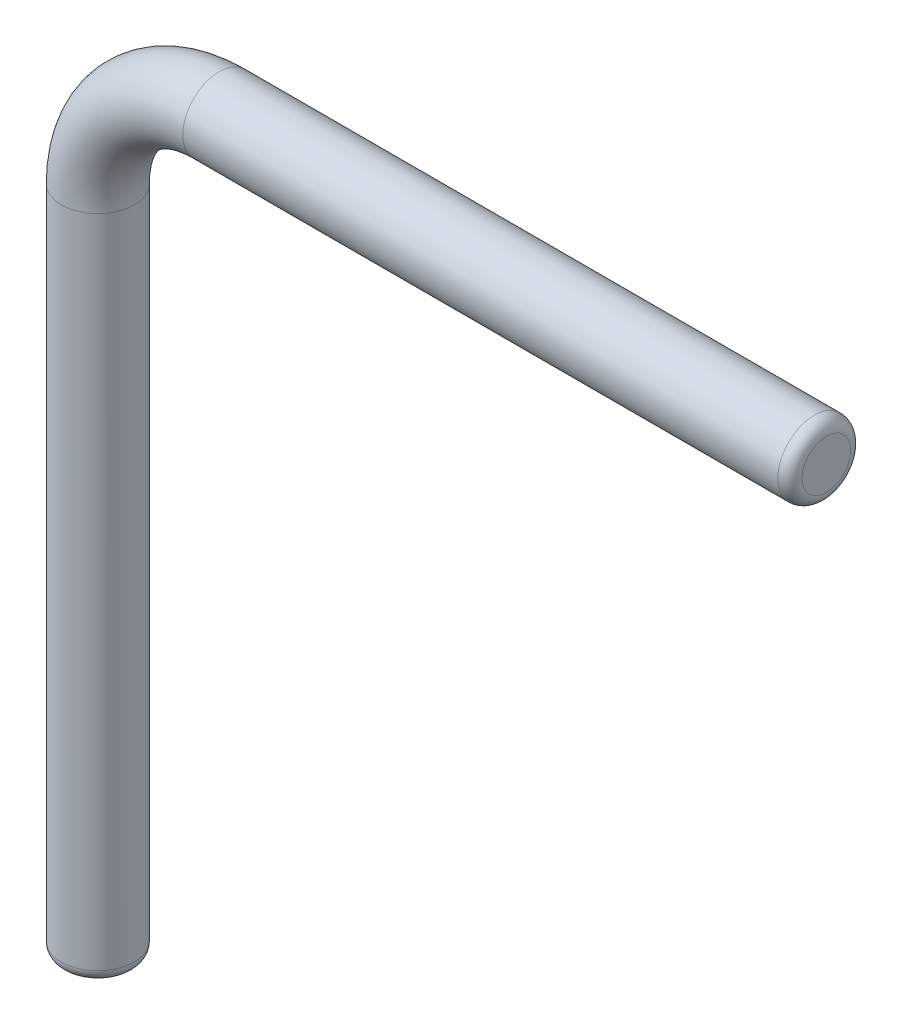
ISO-10303-21;
HEADER;
FILE_DESCRIPTION(('STEP AP214'),'2;1');
FILE_NAME('part.step','',(''),(''),'','','');
FILE_SCHEMA(('AUTOMOTIVE_DESIGN { 1 0 10303 214 1 1 1 1 }'));
ENDSEC;
DATA;
#1=APPLICATION_CONTEXT('core data for automotive mechanical design processes');
#2=APPLICATION_PROTOCOL_DEFINITION('international standard','automotive_design',2000,#1);
#3=PRODUCT_CONTEXT('',#1,'mechanical');
#4=PRODUCT('Part','Part','',(#3));
#5=PRODUCT_RELATED_PRODUCT_CATEGORY('part','',(#4));
#6=PRODUCT_DEFINITION_FORMATION('','',#4);
#7=PRODUCT_DEFINITION_CONTEXT('part definition',#1,'design');
#8=PRODUCT_DEFINITION('design','',#6,#7);
#9=PRODUCT_DEFINITION_SHAPE('','',#8);
#10=(LENGTH_UNIT() NAMED_UNIT(*) SI_UNIT(.MILLI.,.METRE.));
#11=(NAMED_UNIT(*) PLANE_ANGLE_UNIT() SI_UNIT($,.RADIAN.));
#12=(NAMED_UNIT(*) SI_UNIT($,.STERADIAN.) SOLID_ANGLE_UNIT());
#13=UNCERTAINTY_MEASURE_WITH_UNIT(LENGTH_MEASURE(1.E-05),#10,'distance_accuracy_value','');
#14=(GEOMETRIC_REPRESENTATION_CONTEXT(3) GLOBAL_UNCERTAINTY_ASSIGNED_CONTEXT((#13)) GLOBAL_UNIT_ASSIGNED_CONTEXT((#10,
#11,#12)) REPRESENTATION_CONTEXT('',''));
#15=CARTESIAN_POINT('',(0.,0.,0.));
#16=DIRECTION('',(0.,0.,1.));
#17=DIRECTION('',(1.,0.,0.));
#18=AXIS2_PLACEMENT_3D('',#15,#16,#17);
#19=CARTESIAN_POINT('',(1.,6.5,0.));
#20=DIRECTION('',(1.,0.,0.));
#21=DIRECTION('',(0.,0.,-1.));
#22=AXIS2_PLACEMENT_3D('',#19,#20,#21);
#23=CYLINDRICAL_SURFACE('',#22,0.3);
#24=CARTESIAN_POINT('',(5.9,6.5,0.));
#25=DIRECTION('',(1.,0.,0.));
#26=DIRECTION('',(0.,1.,0.));
#27=AXIS2_PLACEMENT_3D('',#24,#25,#26);
#28=CIRCLE('',#27,0.3);
#29=CARTESIAN_POINT('',(5.9,6.8,0.));
#30=VERTEX_POINT('',#29);
#31=EDGE_CURVE('E41',#30,#30,#28,.F.);
#32=ORIENTED_EDGE('',*,*,#31,.T.);
#33=EDGE_LOOP('',(#32));
#34=FACE_BOUND('',#33,.T.);
#35=CARTESIAN_POINT('',(1.,6.5,0.));
#36=DIRECTION('',(1.,0.,0.));
#37=DIRECTION('',(0.,0.,1.));
#38=AXIS2_PLACEMENT_3D('',#35,#36,#37);
#39=CIRCLE('',#38,0.3);
#40=CARTESIAN_POINT('',(1.,6.8,0.));
#41=VERTEX_POINT('',#40);
#42=EDGE_CURVE('E50',#41,#41,#39,.T.);
#43=ORIENTED_EDGE('',*,*,#42,.T.);
#44=EDGE_LOOP('',(#43));
#45=FACE_BOUND('',#44,.T.);
#46=ADVANCED_FACE('F30',(#34,#45),#23,.T.);
#47=CARTESIAN_POINT('',(1.,5.5,0.));
#48=DIRECTION('',(0.,0.,-1.));
#49=DIRECTION('',(-1.,0.,0.));
#50=AXIS2_PLACEMENT_3D('',#47,#48,#49);
#51=TOROIDAL_SURFACE('',#50,1.,0.3);
#52=CARTESIAN_POINT('',(0.,5.5,0.));
#53=DIRECTION('',(0.,1.,0.));
#54=DIRECTION('',(0.,0.,1.));
#55=AXIS2_PLACEMENT_3D('',#52,#53,#54);
#56=CIRCLE('',#55,0.3);
#57=CARTESIAN_POINT('',(-0.3,5.5,0.));
#58=VERTEX_POINT('',#57);
#59=EDGE_CURVE('E53',#58,#58,#56,.T.);
#60=CARTESIAN_POINT('',(1.,5.5,0.));
#61=DIRECTION('',(0.,0.,-1.));
#62=DIRECTION('',(-1.,0.,0.));
#63=AXIS2_PLACEMENT_3D('',#60,#61,#62);
#64=CIRCLE('',#63,1.3);
#65=EDGE_CURVE('',#58,#41,#64,.T.);
#66=ORIENTED_EDGE('',*,*,#59,.T.);
#67=ORIENTED_EDGE('',*,*,#42,.F.);
#68=ORIENTED_EDGE('',*,*,#65,.T.);
#69=ORIENTED_EDGE('',*,*,#65,.F.);
#70=EDGE_LOOP('',(#66,#68,#67,#69));
#71=FACE_BOUND('',#70,.T.);
#72=ADVANCED_FACE('F57',(#71),#51,.T.);
#73=CARTESIAN_POINT('',(0.,5.5,0.));
#74=DIRECTION('',(0.,-1.,0.));
#75=DIRECTION('',(0.,0.,-1.));
#76=AXIS2_PLACEMENT_3D('',#73,#74,#75);
#77=CYLINDRICAL_SURFACE('',#76,0.3);
#78=CARTESIAN_POINT('',(0.,0.1,0.));
#79=DIRECTION('',(0.,1.,0.));
#80=DIRECTION('',(0.,0.,1.));
#81=AXIS2_PLACEMENT_3D('',#78,#79,#80);
#82=CIRCLE('',#81,0.3);
#83=CARTESIAN_POINT('',(0.,0.1,0.3));
#84=VERTEX_POINT('',#83);
#85=EDGE_CURVE('E37',#84,#84,#82,.T.);
#86=ORIENTED_EDGE('',*,*,#85,.T.);
#87=EDGE_LOOP('',(#86));
#88=FACE_BOUND('',#87,.T.);
#89=ORIENTED_EDGE('',*,*,#59,.F.);
#90=EDGE_LOOP('',(#89));
#91=FACE_BOUND('',#90,.T.);
#92=ADVANCED_FACE('F60',(#88,#91),#77,.T.);
#93=CARTESIAN_POINT('',(6.,6.5,0.));
#94=DIRECTION('',(1.,0.,0.));
#95=DIRECTION('',(0.,0.,1.));
#96=AXIS2_PLACEMENT_3D('',#93,#94,#95);
#97=PLANE('',#96);
#98=CARTESIAN_POINT('',(6.,6.5,0.));
#99=DIRECTION('',(1.,0.,0.));
#100=DIRECTION('',(0.,1.,0.));
#101=AXIS2_PLACEMENT_3D('',#98,#99,#100);
#102=CIRCLE('',#101,0.2);
#103=CARTESIAN_POINT('',(6.,6.7,0.));
#104=VERTEX_POINT('',#103);
#105=EDGE_CURVE('E45',#104,#104,#102,.T.);
#106=ORIENTED_EDGE('',*,*,#105,.T.);
#107=EDGE_LOOP('',(#106));
#108=FACE_BOUND('',#107,.T.);
#109=ADVANCED_FACE('F62',(#108),#97,.T.);
#110=CARTESIAN_POINT('',(0.,0.,0.));
#111=DIRECTION('',(0.,1.,0.));
#112=DIRECTION('',(0.,0.,1.));
#113=AXIS2_PLACEMENT_3D('',#110,#111,#112);
#114=PLANE('',#113);
#115=CARTESIAN_POINT('',(0.,0.,0.));
#116=DIRECTION('',(0.,1.,0.));
#117=DIRECTION('',(0.,0.,1.));
#118=AXIS2_PLACEMENT_3D('',#115,#116,#117);
#119=CIRCLE('',#118,0.2);
#120=CARTESIAN_POINT('',(0.,0.,0.2));
#121=VERTEX_POINT('',#120);
#122=EDGE_CURVE('E10',#121,#121,#119,.F.);
#123=ORIENTED_EDGE('',*,*,#122,.T.);
#124=EDGE_LOOP('',(#123));
#125=FACE_BOUND('',#124,.T.);
#126=ADVANCED_FACE('F68',(#125),#114,.F.);
#127=CARTESIAN_POINT('',(5.9,6.5,0.));
#128=DIRECTION('',(1.,0.,0.));
#129=DIRECTION('',(0.,1.,0.));
#130=AXIS2_PLACEMENT_3D('',#127,#128,#129);
#131=TOROIDAL_SURFACE('',#130,0.2,0.1);
#132=ORIENTED_EDGE('',*,*,#31,.F.);
#133=EDGE_LOOP('',(#132));
#134=FACE_BOUND('',#133,.T.);
#135=ORIENTED_EDGE('',*,*,#105,.F.);
#136=EDGE_LOOP('',(#135));
#137=FACE_BOUND('',#136,.T.);
#138=ADVANCED_FACE('F79',(#134,#137),#131,.T.);
#139=CARTESIAN_POINT('',(0.,0.1,0.));
#140=DIRECTION('',(0.,1.,0.));
#141=DIRECTION('',(0.,0.,1.));
#142=AXIS2_PLACEMENT_3D('',#139,#140,#141);
#143=TOROIDAL_SURFACE('',#142,0.2,0.1);
#144=ORIENTED_EDGE('',*,*,#122,.F.);
#145=EDGE_LOOP('',(#144));
#146=FACE_BOUND('',#145,.T.);
#147=ORIENTED_EDGE('',*,*,#85,.F.);
#148=EDGE_LOOP('',(#147));
#149=FACE_BOUND('',#148,.T.);
#150=ADVANCED_FACE('F32',(#146,#149),#143,.T.);
#151=CLOSED_SHELL('',(#46,#72,#92,#109,#126,#138,#150));
#152=MANIFOLD_SOLID_BREP('B2',#151);
#153=ADVANCED_BREP_SHAPE_REPRESENTATION('',(#18,#152),#14);
#154=SHAPE_DEFINITION_REPRESENTATION(#9,#153);
ENDSEC;
END-ISO-10303-21;
